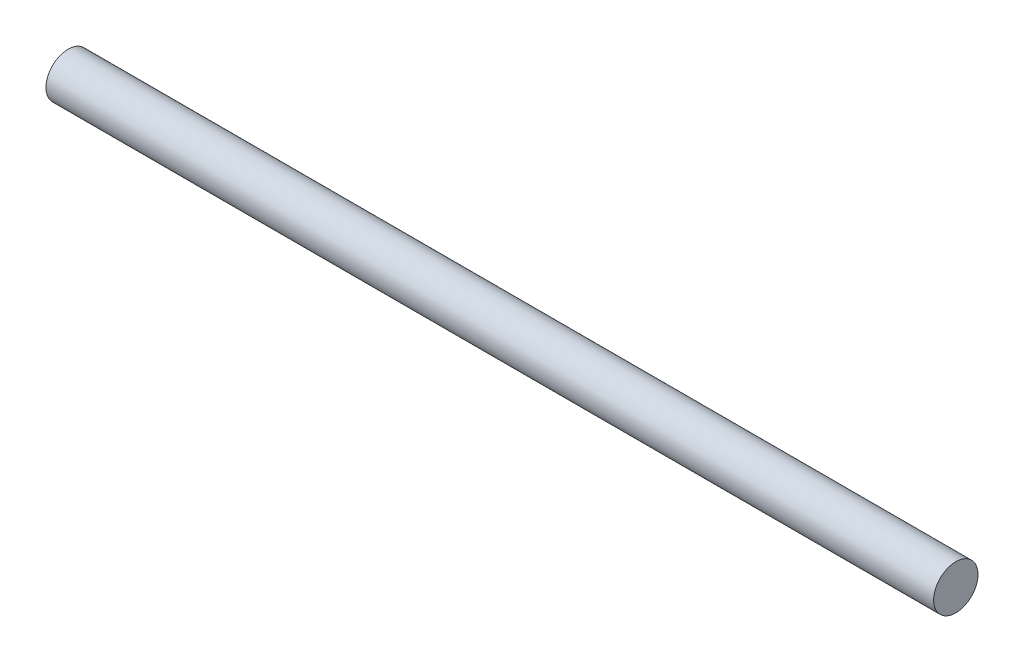
ISO-10303-21;
HEADER;
FILE_DESCRIPTION(('STEP AP214'),'2;1');
FILE_NAME('part.step','',(''),(''),'','','');
FILE_SCHEMA(('AUTOMOTIVE_DESIGN { 1 0 10303 214 1 1 1 1 }'));
ENDSEC;
DATA;
#1=APPLICATION_CONTEXT('core data for automotive mechanical design processes');
#2=APPLICATION_PROTOCOL_DEFINITION('international standard','automotive_design',2000,#1);
#3=PRODUCT_CONTEXT('',#1,'mechanical');
#4=PRODUCT('Part','Part','',(#3));
#5=PRODUCT_RELATED_PRODUCT_CATEGORY('part','',(#4));
#6=PRODUCT_DEFINITION_FORMATION('','',#4);
#7=PRODUCT_DEFINITION_CONTEXT('part definition',#1,'design');
#8=PRODUCT_DEFINITION('design','',#6,#7);
#9=PRODUCT_DEFINITION_SHAPE('','',#8);
#10=(LENGTH_UNIT() NAMED_UNIT(*) SI_UNIT(.MILLI.,.METRE.));
#11=(NAMED_UNIT(*) PLANE_ANGLE_UNIT() SI_UNIT($,.RADIAN.));
#12=(NAMED_UNIT(*) SI_UNIT($,.STERADIAN.) SOLID_ANGLE_UNIT());
#13=UNCERTAINTY_MEASURE_WITH_UNIT(LENGTH_MEASURE(1.E-05),#10,'distance_accuracy_value','');
#14=(GEOMETRIC_REPRESENTATION_CONTEXT(3) GLOBAL_UNCERTAINTY_ASSIGNED_CONTEXT((#13)) GLOBAL_UNIT_ASSIGNED_CONTEXT((#10,
#11,#12)) REPRESENTATION_CONTEXT('',''));
#15=CARTESIAN_POINT('',(0.,0.,0.));
#16=DIRECTION('',(0.,0.,1.));
#17=DIRECTION('',(1.,0.,0.));
#18=AXIS2_PLACEMENT_3D('',#15,#16,#17);
#19=CARTESIAN_POINT('',(30.,11.0629921714462,22.6945002168009));
#20=DIRECTION('',(-1.,0.,0.));
#21=DIRECTION('',(0.,0.,1.));
#22=AXIS2_PLACEMENT_3D('',#19,#20,#21);
#23=CYLINDRICAL_SURFACE('',#22,0.750000000000002);
#24=CARTESIAN_POINT('',(30.,11.0629921714462,22.6945002168009));
#25=DIRECTION('',(1.,0.,0.));
#26=DIRECTION('',(0.,0.,-1.));
#27=AXIS2_PLACEMENT_3D('',#24,#25,#26);
#28=CIRCLE('',#27,0.750000000000002);
#29=CARTESIAN_POINT('',(30.,11.0629921714462,21.9445002168009));
#30=VERTEX_POINT('',#29);
#31=EDGE_CURVE('E10',#30,#30,#28,.T.);
#32=ORIENTED_EDGE('',*,*,#31,.F.);
#33=EDGE_LOOP('',(#32));
#34=FACE_BOUND('',#33,.T.);
#35=CARTESIAN_POINT('',(0.,11.0629921714462,22.6945002168009));
#36=DIRECTION('',(1.,0.,0.));
#37=DIRECTION('',(0.,0.,-1.));
#38=AXIS2_PLACEMENT_3D('',#35,#36,#37);
#39=CIRCLE('',#38,0.750000000000002);
#40=CARTESIAN_POINT('',(0.,11.0629921714462,21.9445002168009));
#41=VERTEX_POINT('',#40);
#42=EDGE_CURVE('E34',#41,#41,#39,.T.);
#43=ORIENTED_EDGE('',*,*,#42,.T.);
#44=EDGE_LOOP('',(#43));
#45=FACE_BOUND('',#44,.T.);
#46=ADVANCED_FACE('F31',(#34,#45),#23,.T.);
#47=CARTESIAN_POINT('',(30.,11.0629921714462,22.6945002168009));
#48=DIRECTION('',(1.,0.,0.));
#49=DIRECTION('',(0.,0.,-1.));
#50=AXIS2_PLACEMENT_3D('',#47,#48,#49);
#51=PLANE('',#50);
#52=ORIENTED_EDGE('',*,*,#31,.T.);
#53=EDGE_LOOP('',(#52));
#54=FACE_BOUND('',#53,.T.);
#55=ADVANCED_FACE('F46',(#54),#51,.T.);
#56=CARTESIAN_POINT('',(0.,11.0629921714462,22.6945002168009));
#57=DIRECTION('',(1.,0.,0.));
#58=DIRECTION('',(0.,0.,-1.));
#59=AXIS2_PLACEMENT_3D('',#56,#57,#58);
#60=PLANE('',#59);
#61=ORIENTED_EDGE('',*,*,#42,.F.);
#62=EDGE_LOOP('',(#61));
#63=FACE_BOUND('',#62,.T.);
#64=ADVANCED_FACE('F44',(#63),#60,.F.);
#65=CLOSED_SHELL('',(#46,#55,#64));
#66=MANIFOLD_SOLID_BREP('B2',#65);
#67=ADVANCED_BREP_SHAPE_REPRESENTATION('',(#18,#66),#14);
#68=SHAPE_DEFINITION_REPRESENTATION(#9,#67);
ENDSEC;
END-ISO-10303-21;
